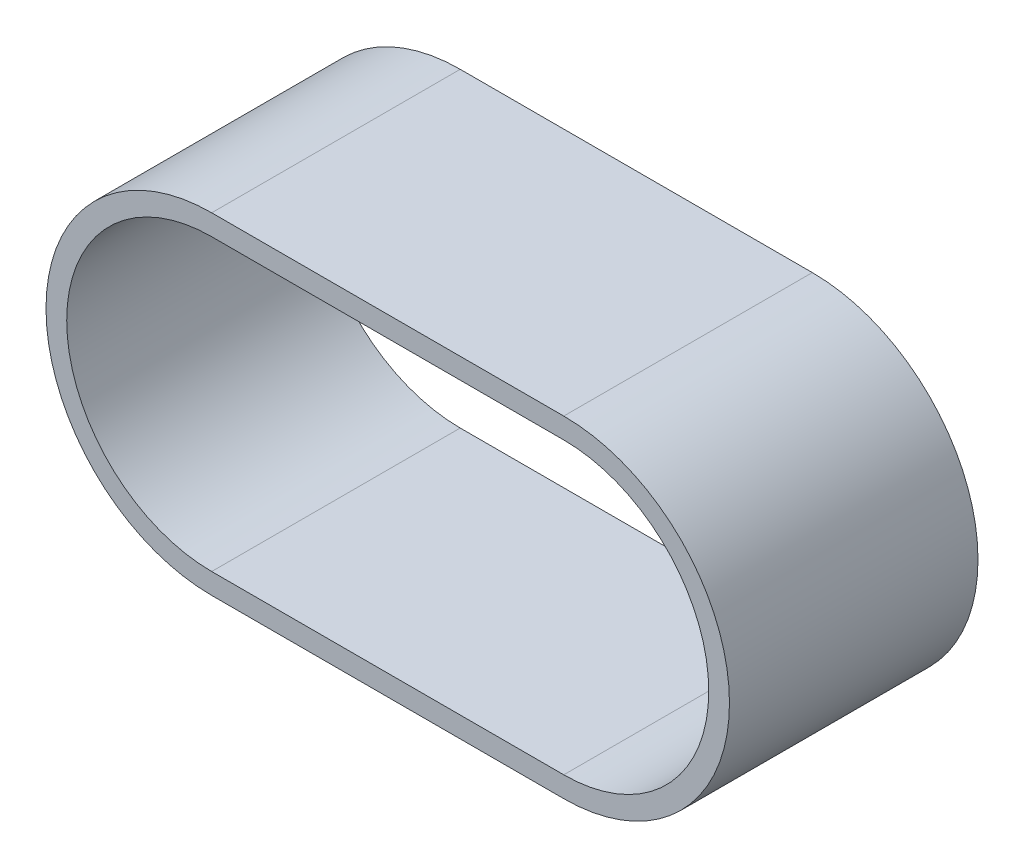
ISO-10303-21;
HEADER;
FILE_DESCRIPTION(('STEP AP214'),'2;1');
FILE_NAME('part.step','',(''),(''),'','','');
FILE_SCHEMA(('AUTOMOTIVE_DESIGN { 1 0 10303 214 1 1 1 1 }'));
ENDSEC;
DATA;
#1=APPLICATION_CONTEXT('core data for automotive mechanical design processes');
#2=APPLICATION_PROTOCOL_DEFINITION('international standard','automotive_design',2000,#1);
#3=PRODUCT_CONTEXT('',#1,'mechanical');
#4=PRODUCT('Part','Part','',(#3));
#5=PRODUCT_RELATED_PRODUCT_CATEGORY('part','',(#4));
#6=PRODUCT_DEFINITION_FORMATION('','',#4);
#7=PRODUCT_DEFINITION_CONTEXT('part definition',#1,'design');
#8=PRODUCT_DEFINITION('design','',#6,#7);
#9=PRODUCT_DEFINITION_SHAPE('','',#8);
#10=(LENGTH_UNIT() NAMED_UNIT(*) SI_UNIT(.MILLI.,.METRE.));
#11=(NAMED_UNIT(*) PLANE_ANGLE_UNIT() SI_UNIT($,.RADIAN.));
#12=(NAMED_UNIT(*) SI_UNIT($,.STERADIAN.) SOLID_ANGLE_UNIT());
#13=UNCERTAINTY_MEASURE_WITH_UNIT(LENGTH_MEASURE(1.E-05),#10,'distance_accuracy_value','');
#14=(GEOMETRIC_REPRESENTATION_CONTEXT(3) GLOBAL_UNCERTAINTY_ASSIGNED_CONTEXT((#13)) GLOBAL_UNIT_ASSIGNED_CONTEXT((#10,
#11,#12)) REPRESENTATION_CONTEXT('',''));
#15=CARTESIAN_POINT('',(0.,0.,0.));
#16=DIRECTION('',(0.,0.,1.));
#17=DIRECTION('',(1.,0.,0.));
#18=AXIS2_PLACEMENT_3D('',#15,#16,#17);
#19=CARTESIAN_POINT('',(0.,0.,60.));
#20=DIRECTION('',(0.,0.,1.));
#21=DIRECTION('',(1.,0.,0.));
#22=AXIS2_PLACEMENT_3D('',#19,#20,#21);
#23=PLANE('',#22);
#24=CARTESIAN_POINT('',(0.,0.,60.));
#25=DIRECTION('',(0.,0.,1.));
#26=DIRECTION('',(1.,0.,0.));
#27=AXIS2_PLACEMENT_3D('',#24,#25,#26);
#28=CIRCLE('',#27,40.);
#29=CARTESIAN_POINT('',(0.,40.,60.));
#30=VERTEX_POINT('',#29);
#31=CARTESIAN_POINT('',(0.,-40.,60.));
#32=VERTEX_POINT('',#31);
#33=EDGE_CURVE('E134',#30,#32,#28,.T.);
#34=ORIENTED_EDGE('',*,*,#33,.T.);
#35=DIRECTION('',(1.,0.,0.));
#36=VECTOR('',#35,1.);
#37=CARTESIAN_POINT('',(0.,-40.,60.));
#38=LINE('',#37,#36);
#39=CARTESIAN_POINT('',(85.,-40.,60.));
#40=VERTEX_POINT('',#39);
#41=EDGE_CURVE('E137',#32,#40,#38,.T.);
#42=ORIENTED_EDGE('',*,*,#41,.T.);
#43=CARTESIAN_POINT('',(85.,0.,60.));
#44=DIRECTION('',(0.,0.,1.));
#45=DIRECTION('',(1.,0.,0.));
#46=AXIS2_PLACEMENT_3D('',#43,#44,#45);
#47=CIRCLE('',#46,40.);
#48=CARTESIAN_POINT('',(85.,40.,60.));
#49=VERTEX_POINT('',#48);
#50=EDGE_CURVE('E140',#40,#49,#47,.T.);
#51=ORIENTED_EDGE('',*,*,#50,.T.);
#52=DIRECTION('',(-1.,0.,0.));
#53=VECTOR('',#52,1.);
#54=CARTESIAN_POINT('',(0.,40.,60.));
#55=LINE('',#54,#53);
#56=EDGE_CURVE('E142',#49,#30,#55,.T.);
#57=ORIENTED_EDGE('',*,*,#56,.T.);
#58=EDGE_LOOP('',(#34,#42,#51,#57));
#59=FACE_BOUND('',#58,.T.);
#60=DIRECTION('',(1.,0.,0.));
#61=VECTOR('',#60,1.);
#62=CARTESIAN_POINT('',(0.,-35.,60.));
#63=LINE('',#62,#61);
#64=CARTESIAN_POINT('',(0.,-35.,60.));
#65=VERTEX_POINT('',#64);
#66=CARTESIAN_POINT('',(85.,-35.,60.));
#67=VERTEX_POINT('',#66);
#68=EDGE_CURVE('E106',#65,#67,#63,.T.);
#69=ORIENTED_EDGE('',*,*,#68,.F.);
#70=CARTESIAN_POINT('',(0.,0.,60.));
#71=DIRECTION('',(0.,0.,1.));
#72=DIRECTION('',(1.,0.,0.));
#73=AXIS2_PLACEMENT_3D('',#70,#71,#72);
#74=CIRCLE('',#73,35.);
#75=CARTESIAN_POINT('',(0.,35.,60.));
#76=VERTEX_POINT('',#75);
#77=EDGE_CURVE('E98',#76,#65,#74,.T.);
#78=ORIENTED_EDGE('',*,*,#77,.F.);
#79=DIRECTION('',(-1.,0.,0.));
#80=VECTOR('',#79,1.);
#81=CARTESIAN_POINT('',(0.,35.,60.));
#82=LINE('',#81,#80);
#83=CARTESIAN_POINT('',(85.,35.,60.));
#84=VERTEX_POINT('',#83);
#85=EDGE_CURVE('E120',#84,#76,#82,.T.);
#86=ORIENTED_EDGE('',*,*,#85,.F.);
#87=CARTESIAN_POINT('',(85.,0.,60.));
#88=DIRECTION('',(0.,0.,1.));
#89=DIRECTION('',(1.,0.,0.));
#90=AXIS2_PLACEMENT_3D('',#87,#88,#89);
#91=CIRCLE('',#90,35.);
#92=EDGE_CURVE('E118',#67,#84,#91,.T.);
#93=ORIENTED_EDGE('',*,*,#92,.F.);
#94=EDGE_LOOP('',(#69,#78,#86,#93));
#95=FACE_BOUND('',#94,.T.);
#96=ADVANCED_FACE('F33',(#59,#95),#23,.T.);
#97=CARTESIAN_POINT('',(0.,0.,0.));
#98=DIRECTION('',(0.,0.,1.));
#99=DIRECTION('',(1.,0.,0.));
#100=AXIS2_PLACEMENT_3D('',#97,#98,#99);
#101=PLANE('',#100);
#102=CARTESIAN_POINT('',(0.,0.,0.));
#103=DIRECTION('',(0.,0.,1.));
#104=DIRECTION('',(1.,0.,0.));
#105=AXIS2_PLACEMENT_3D('',#102,#103,#104);
#106=CIRCLE('',#105,40.);
#107=CARTESIAN_POINT('',(0.,40.,0.));
#108=VERTEX_POINT('',#107);
#109=CARTESIAN_POINT('',(0.,-40.,0.));
#110=VERTEX_POINT('',#109);
#111=EDGE_CURVE('E114',#108,#110,#106,.T.);
#112=ORIENTED_EDGE('',*,*,#111,.F.);
#113=DIRECTION('',(-1.,0.,0.));
#114=VECTOR('',#113,1.);
#115=CARTESIAN_POINT('',(0.,40.,0.));
#116=LINE('',#115,#114);
#117=CARTESIAN_POINT('',(85.,40.,0.));
#118=VERTEX_POINT('',#117);
#119=EDGE_CURVE('E138',#118,#108,#116,.T.);
#120=ORIENTED_EDGE('',*,*,#119,.F.);
#121=CARTESIAN_POINT('',(85.,0.,0.));
#122=DIRECTION('',(0.,0.,1.));
#123=DIRECTION('',(1.,0.,0.));
#124=AXIS2_PLACEMENT_3D('',#121,#122,#123);
#125=CIRCLE('',#124,40.);
#126=CARTESIAN_POINT('',(85.,-40.,0.));
#127=VERTEX_POINT('',#126);
#128=EDGE_CURVE('E149',#127,#118,#125,.T.);
#129=ORIENTED_EDGE('',*,*,#128,.F.);
#130=DIRECTION('',(1.,0.,0.));
#131=VECTOR('',#130,1.);
#132=CARTESIAN_POINT('',(0.,-40.,0.));
#133=LINE('',#132,#131);
#134=EDGE_CURVE('E147',#110,#127,#133,.T.);
#135=ORIENTED_EDGE('',*,*,#134,.F.);
#136=EDGE_LOOP('',(#112,#120,#129,#135));
#137=FACE_BOUND('',#136,.T.);
#138=CARTESIAN_POINT('',(0.,0.,0.));
#139=DIRECTION('',(0.,0.,1.));
#140=DIRECTION('',(1.,0.,0.));
#141=AXIS2_PLACEMENT_3D('',#138,#139,#140);
#142=CIRCLE('',#141,35.);
#143=CARTESIAN_POINT('',(0.,35.,0.));
#144=VERTEX_POINT('',#143);
#145=CARTESIAN_POINT('',(0.,-35.,0.));
#146=VERTEX_POINT('',#145);
#147=EDGE_CURVE('E56',#144,#146,#142,.T.);
#148=ORIENTED_EDGE('',*,*,#147,.T.);
#149=DIRECTION('',(1.,0.,0.));
#150=VECTOR('',#149,1.);
#151=CARTESIAN_POINT('',(0.,-35.,0.));
#152=LINE('',#151,#150);
#153=CARTESIAN_POINT('',(85.,-35.,0.));
#154=VERTEX_POINT('',#153);
#155=EDGE_CURVE('E113',#146,#154,#152,.T.);
#156=ORIENTED_EDGE('',*,*,#155,.T.);
#157=CARTESIAN_POINT('',(85.,0.,0.));
#158=DIRECTION('',(0.,0.,1.));
#159=DIRECTION('',(1.,0.,0.));
#160=AXIS2_PLACEMENT_3D('',#157,#158,#159);
#161=CIRCLE('',#160,35.);
#162=CARTESIAN_POINT('',(85.,35.,0.));
#163=VERTEX_POINT('',#162);
#164=EDGE_CURVE('E126',#154,#163,#161,.T.);
#165=ORIENTED_EDGE('',*,*,#164,.T.);
#166=DIRECTION('',(-1.,0.,0.));
#167=VECTOR('',#166,1.);
#168=CARTESIAN_POINT('',(0.,35.,0.));
#169=LINE('',#168,#167);
#170=EDGE_CURVE('E107',#163,#144,#169,.T.);
#171=ORIENTED_EDGE('',*,*,#170,.T.);
#172=EDGE_LOOP('',(#148,#156,#165,#171));
#173=FACE_BOUND('',#172,.T.);
#174=ADVANCED_FACE('F167',(#137,#173),#101,.F.);
#175=CARTESIAN_POINT('',(0.,0.,60.));
#176=DIRECTION('',(0.,0.,-1.));
#177=DIRECTION('',(-1.,0.,0.));
#178=AXIS2_PLACEMENT_3D('',#175,#176,#177);
#179=CYLINDRICAL_SURFACE('',#178,40.);
#180=ORIENTED_EDGE('',*,*,#111,.T.);
#181=DIRECTION('',(0.,0.,-1.));
#182=VECTOR('',#181,1.);
#183=CARTESIAN_POINT('',(0.,-40.,60.));
#184=LINE('',#183,#182);
#185=EDGE_CURVE('E11',#32,#110,#184,.T.);
#186=ORIENTED_EDGE('',*,*,#185,.F.);
#187=ORIENTED_EDGE('',*,*,#33,.F.);
#188=DIRECTION('',(0.,0.,-1.));
#189=VECTOR('',#188,1.);
#190=CARTESIAN_POINT('',(0.,40.,60.));
#191=LINE('',#190,#189);
#192=EDGE_CURVE('E144',#30,#108,#191,.T.);
#193=ORIENTED_EDGE('',*,*,#192,.T.);
#194=EDGE_LOOP('',(#180,#186,#187,#193));
#195=FACE_BOUND('',#194,.T.);
#196=ADVANCED_FACE('F35',(#195),#179,.T.);
#197=CARTESIAN_POINT('',(0.,-40.,60.));
#198=DIRECTION('',(0.,1.,0.));
#199=DIRECTION('',(0.,0.,1.));
#200=AXIS2_PLACEMENT_3D('',#197,#198,#199);
#201=PLANE('',#200);
#202=ORIENTED_EDGE('',*,*,#134,.T.);
#203=DIRECTION('',(0.,0.,-1.));
#204=VECTOR('',#203,1.);
#205=CARTESIAN_POINT('',(85.,-40.,60.));
#206=LINE('',#205,#204);
#207=EDGE_CURVE('E41',#40,#127,#206,.T.);
#208=ORIENTED_EDGE('',*,*,#207,.F.);
#209=ORIENTED_EDGE('',*,*,#41,.F.);
#210=ORIENTED_EDGE('',*,*,#185,.T.);
#211=EDGE_LOOP('',(#202,#208,#209,#210));
#212=FACE_BOUND('',#211,.T.);
#213=ADVANCED_FACE('F177',(#212),#201,.F.);
#214=CARTESIAN_POINT('',(85.,0.,60.));
#215=DIRECTION('',(0.,0.,-1.));
#216=DIRECTION('',(-1.,0.,0.));
#217=AXIS2_PLACEMENT_3D('',#214,#215,#216);
#218=CYLINDRICAL_SURFACE('',#217,40.);
#219=ORIENTED_EDGE('',*,*,#128,.T.);
#220=DIRECTION('',(0.,0.,-1.));
#221=VECTOR('',#220,1.);
#222=CARTESIAN_POINT('',(85.,40.,60.));
#223=LINE('',#222,#221);
#224=EDGE_CURVE('E154',#49,#118,#223,.T.);
#225=ORIENTED_EDGE('',*,*,#224,.F.);
#226=ORIENTED_EDGE('',*,*,#50,.F.);
#227=ORIENTED_EDGE('',*,*,#207,.T.);
#228=EDGE_LOOP('',(#219,#225,#226,#227));
#229=FACE_BOUND('',#228,.T.);
#230=ADVANCED_FACE('F161',(#229),#218,.T.);
#231=CARTESIAN_POINT('',(0.,40.,60.));
#232=DIRECTION('',(0.,-1.,0.));
#233=DIRECTION('',(0.,0.,-1.));
#234=AXIS2_PLACEMENT_3D('',#231,#232,#233);
#235=PLANE('',#234);
#236=ORIENTED_EDGE('',*,*,#119,.T.);
#237=ORIENTED_EDGE('',*,*,#192,.F.);
#238=ORIENTED_EDGE('',*,*,#56,.F.);
#239=ORIENTED_EDGE('',*,*,#224,.T.);
#240=EDGE_LOOP('',(#236,#237,#238,#239));
#241=FACE_BOUND('',#240,.T.);
#242=ADVANCED_FACE('F171',(#241),#235,.F.);
#243=CARTESIAN_POINT('',(0.,0.,60.));
#244=DIRECTION('',(0.,0.,-1.));
#245=DIRECTION('',(-1.,0.,0.));
#246=AXIS2_PLACEMENT_3D('',#243,#244,#245);
#247=CYLINDRICAL_SURFACE('',#246,35.);
#248=ORIENTED_EDGE('',*,*,#147,.F.);
#249=DIRECTION('',(0.,0.,-1.));
#250=VECTOR('',#249,1.);
#251=CARTESIAN_POINT('',(0.,35.,60.));
#252=LINE('',#251,#250);
#253=EDGE_CURVE('E102',#76,#144,#252,.T.);
#254=ORIENTED_EDGE('',*,*,#253,.F.);
#255=ORIENTED_EDGE('',*,*,#77,.T.);
#256=DIRECTION('',(0.,0.,-1.));
#257=VECTOR('',#256,1.);
#258=CARTESIAN_POINT('',(0.,-35.,60.));
#259=LINE('',#258,#257);
#260=EDGE_CURVE('E101',#65,#146,#259,.T.);
#261=ORIENTED_EDGE('',*,*,#260,.T.);
#262=EDGE_LOOP('',(#248,#254,#255,#261));
#263=FACE_BOUND('',#262,.T.);
#264=ADVANCED_FACE('F100',(#263),#247,.F.);
#265=CARTESIAN_POINT('',(0.,-35.,60.));
#266=DIRECTION('',(0.,1.,0.));
#267=DIRECTION('',(0.,0.,1.));
#268=AXIS2_PLACEMENT_3D('',#265,#266,#267);
#269=PLANE('',#268);
#270=ORIENTED_EDGE('',*,*,#155,.F.);
#271=ORIENTED_EDGE('',*,*,#260,.F.);
#272=ORIENTED_EDGE('',*,*,#68,.T.);
#273=DIRECTION('',(0.,0.,-1.));
#274=VECTOR('',#273,1.);
#275=CARTESIAN_POINT('',(85.,-35.,60.));
#276=LINE('',#275,#274);
#277=EDGE_CURVE('E115',#67,#154,#276,.T.);
#278=ORIENTED_EDGE('',*,*,#277,.T.);
#279=EDGE_LOOP('',(#270,#271,#272,#278));
#280=FACE_BOUND('',#279,.T.);
#281=ADVANCED_FACE('F110',(#280),#269,.T.);
#282=CARTESIAN_POINT('',(85.,0.,60.));
#283=DIRECTION('',(0.,0.,-1.));
#284=DIRECTION('',(-1.,0.,0.));
#285=AXIS2_PLACEMENT_3D('',#282,#283,#284);
#286=CYLINDRICAL_SURFACE('',#285,35.);
#287=ORIENTED_EDGE('',*,*,#164,.F.);
#288=ORIENTED_EDGE('',*,*,#277,.F.);
#289=ORIENTED_EDGE('',*,*,#92,.T.);
#290=DIRECTION('',(0.,0.,-1.));
#291=VECTOR('',#290,1.);
#292=CARTESIAN_POINT('',(85.,35.,60.));
#293=LINE('',#292,#291);
#294=EDGE_CURVE('E48',#84,#163,#293,.T.);
#295=ORIENTED_EDGE('',*,*,#294,.T.);
#296=EDGE_LOOP('',(#287,#288,#289,#295));
#297=FACE_BOUND('',#296,.T.);
#298=ADVANCED_FACE('F200',(#297),#286,.F.);
#299=CARTESIAN_POINT('',(0.,35.,60.));
#300=DIRECTION('',(0.,-1.,0.));
#301=DIRECTION('',(0.,0.,-1.));
#302=AXIS2_PLACEMENT_3D('',#299,#300,#301);
#303=PLANE('',#302);
#304=ORIENTED_EDGE('',*,*,#170,.F.);
#305=ORIENTED_EDGE('',*,*,#294,.F.);
#306=ORIENTED_EDGE('',*,*,#85,.T.);
#307=ORIENTED_EDGE('',*,*,#253,.T.);
#308=EDGE_LOOP('',(#304,#305,#306,#307));
#309=FACE_BOUND('',#308,.T.);
#310=ADVANCED_FACE('F204',(#309),#303,.T.);
#311=CLOSED_SHELL('',(#96,#174,#196,#213,#230,#242,#264,#281,#298,#310));
#312=MANIFOLD_SOLID_BREP('B2',#311);
#313=ADVANCED_BREP_SHAPE_REPRESENTATION('',(#18,#312),#14);
#314=SHAPE_DEFINITION_REPRESENTATION(#9,#313);
ENDSEC;
END-ISO-10303-21;
